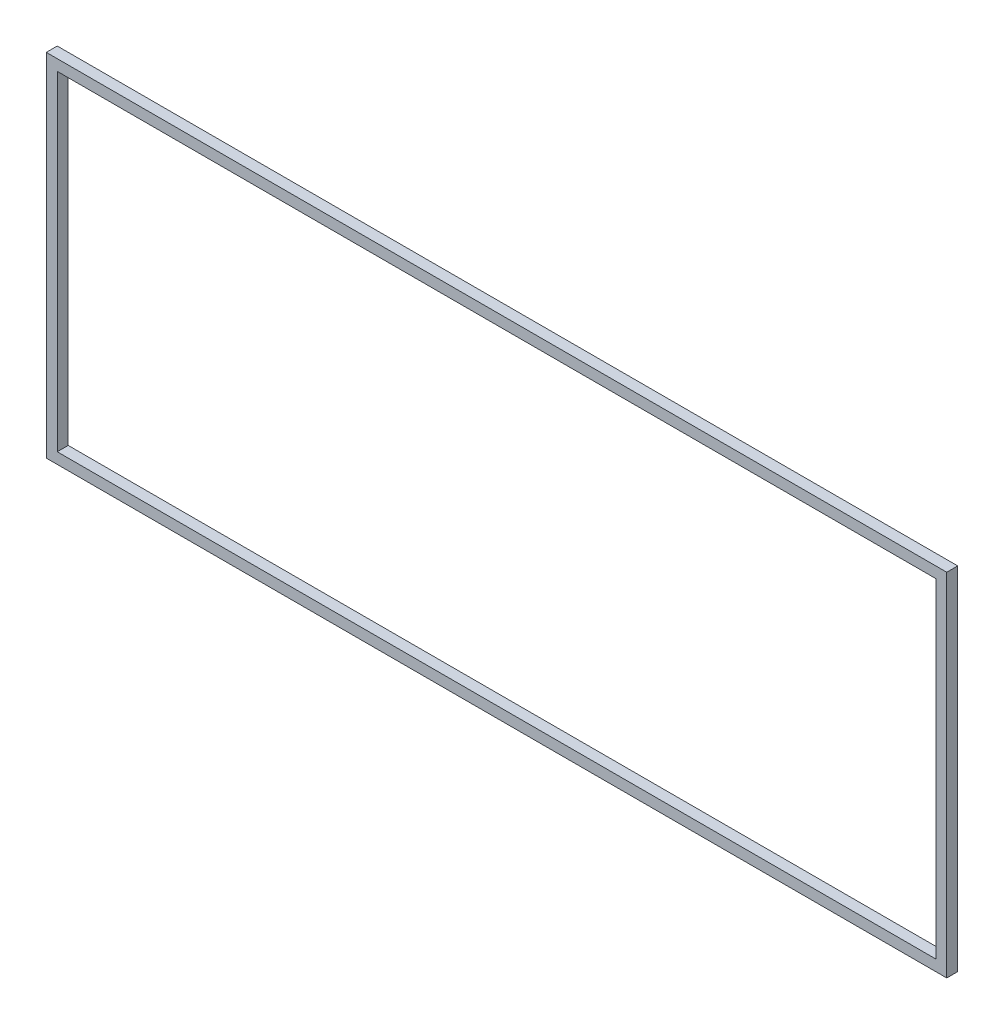
ISO-10303-21;
HEADER;
FILE_DESCRIPTION(('STEP AP214'),'2;1');
FILE_NAME('part.step','',(''),(''),'','','');
FILE_SCHEMA(('AUTOMOTIVE_DESIGN { 1 0 10303 214 1 1 1 1 }'));
ENDSEC;
DATA;
#1=APPLICATION_CONTEXT('core data for automotive mechanical design processes');
#2=APPLICATION_PROTOCOL_DEFINITION('international standard','automotive_design',2000,#1);
#3=PRODUCT_CONTEXT('',#1,'mechanical');
#4=PRODUCT('Part','Part','',(#3));
#5=PRODUCT_RELATED_PRODUCT_CATEGORY('part','',(#4));
#6=PRODUCT_DEFINITION_FORMATION('','',#4);
#7=PRODUCT_DEFINITION_CONTEXT('part definition',#1,'design');
#8=PRODUCT_DEFINITION('design','',#6,#7);
#9=PRODUCT_DEFINITION_SHAPE('','',#8);
#10=(LENGTH_UNIT() NAMED_UNIT(*) SI_UNIT(.MILLI.,.METRE.));
#11=(NAMED_UNIT(*) PLANE_ANGLE_UNIT() SI_UNIT($,.RADIAN.));
#12=(NAMED_UNIT(*) SI_UNIT($,.STERADIAN.) SOLID_ANGLE_UNIT());
#13=UNCERTAINTY_MEASURE_WITH_UNIT(LENGTH_MEASURE(1.E-05),#10,'distance_accuracy_value','');
#14=(GEOMETRIC_REPRESENTATION_CONTEXT(3) GLOBAL_UNCERTAINTY_ASSIGNED_CONTEXT((#13)) GLOBAL_UNIT_ASSIGNED_CONTEXT((#10,
#11,#12)) REPRESENTATION_CONTEXT('',''));
#15=CARTESIAN_POINT('',(0.,0.,0.));
#16=DIRECTION('',(0.,0.,1.));
#17=DIRECTION('',(1.,0.,0.));
#18=AXIS2_PLACEMENT_3D('',#15,#16,#17);
#19=CARTESIAN_POINT('',(87.357368028597,60.6995866341911,-39.));
#20=DIRECTION('',(0.,0.,-1.));
#21=DIRECTION('',(-1.,0.,0.));
#22=AXIS2_PLACEMENT_3D('',#19,#20,#21);
#23=PLANE('',#22);
#24=DIRECTION('',(1.,0.,0.));
#25=VECTOR('',#24,1.);
#26=CARTESIAN_POINT('',(95.457368028597,60.5995866341911,-39.));
#27=LINE('',#26,#25);
#28=CARTESIAN_POINT('',(87.457368028597,60.5995866341911,-39.));
#29=VERTEX_POINT('',#28);
#30=CARTESIAN_POINT('',(95.457368028597,60.5995866341911,-39.));
#31=VERTEX_POINT('',#30);
#32=EDGE_CURVE('E124',#29,#31,#27,.T.);
#33=ORIENTED_EDGE('',*,*,#32,.T.);
#34=DIRECTION('',(0.,1.,0.));
#35=VECTOR('',#34,1.);
#36=CARTESIAN_POINT('',(95.457368028597,57.5995866341911,-39.));
#37=LINE('',#36,#35);
#38=CARTESIAN_POINT('',(95.457368028597,57.5995866341911,-39.));
#39=VERTEX_POINT('',#38);
#40=EDGE_CURVE('E117',#31,#39,#37,.F.);
#41=ORIENTED_EDGE('',*,*,#40,.T.);
#42=DIRECTION('',(1.,0.,0.));
#43=VECTOR('',#42,1.);
#44=CARTESIAN_POINT('',(87.457368028597,57.5995866341911,-39.));
#45=LINE('',#44,#43);
#46=CARTESIAN_POINT('',(87.457368028597,57.5995866341911,-39.));
#47=VERTEX_POINT('',#46);
#48=EDGE_CURVE('E112',#39,#47,#45,.F.);
#49=ORIENTED_EDGE('',*,*,#48,.T.);
#50=DIRECTION('',(0.,1.,0.));
#51=VECTOR('',#50,1.);
#52=CARTESIAN_POINT('',(87.457368028597,60.5995866341911,-39.));
#53=LINE('',#52,#51);
#54=EDGE_CURVE('E108',#47,#29,#53,.T.);
#55=ORIENTED_EDGE('',*,*,#54,.T.);
#56=EDGE_LOOP('',(#33,#41,#49,#55));
#57=FACE_BOUND('',#56,.T.);
#58=DIRECTION('',(1.,0.,0.));
#59=VECTOR('',#58,1.);
#60=CARTESIAN_POINT('',(95.557368028597,57.4995866341911,-39.));
#61=LINE('',#60,#59);
#62=CARTESIAN_POINT('',(87.357368028597,57.4995866341911,-39.));
#63=VERTEX_POINT('',#62);
#64=CARTESIAN_POINT('',(95.557368028597,57.4995866341911,-39.));
#65=VERTEX_POINT('',#64);
#66=EDGE_CURVE('E106',#63,#65,#61,.T.);
#67=ORIENTED_EDGE('',*,*,#66,.T.);
#68=DIRECTION('',(0.,1.,0.));
#69=VECTOR('',#68,1.);
#70=CARTESIAN_POINT('',(95.557368028597,60.6995866341911,-39.));
#71=LINE('',#70,#69);
#72=CARTESIAN_POINT('',(95.557368028597,60.6995866341911,-39.));
#73=VERTEX_POINT('',#72);
#74=EDGE_CURVE('E92',#65,#73,#71,.T.);
#75=ORIENTED_EDGE('',*,*,#74,.T.);
#76=DIRECTION('',(1.,0.,0.));
#77=VECTOR('',#76,1.);
#78=CARTESIAN_POINT('',(87.357368028597,60.6995866341911,-39.));
#79=LINE('',#78,#77);
#80=CARTESIAN_POINT('',(87.357368028597,60.6995866341911,-39.));
#81=VERTEX_POINT('',#80);
#82=EDGE_CURVE('E79',#73,#81,#79,.F.);
#83=ORIENTED_EDGE('',*,*,#82,.T.);
#84=DIRECTION('',(0.,1.,0.));
#85=VECTOR('',#84,1.);
#86=CARTESIAN_POINT('',(87.357368028597,57.4995866341911,-39.));
#87=LINE('',#86,#85);
#88=EDGE_CURVE('E20',#81,#63,#87,.F.);
#89=ORIENTED_EDGE('',*,*,#88,.T.);
#90=EDGE_LOOP('',(#67,#75,#83,#89));
#91=FACE_BOUND('',#90,.T.);
#92=ADVANCED_FACE('F17',(#57,#91),#23,.F.);
#93=CARTESIAN_POINT('',(87.357368028597,57.4995866341911,-39.1));
#94=DIRECTION('',(1.,0.,0.));
#95=DIRECTION('',(0.,0.,-1.));
#96=AXIS2_PLACEMENT_3D('',#93,#94,#95);
#97=PLANE('',#96);
#98=DIRECTION('',(0.,0.,-1.));
#99=VECTOR('',#98,1.);
#100=CARTESIAN_POINT('',(87.357368028597,60.6995866341911,-39.1));
#101=LINE('',#100,#99);
#102=CARTESIAN_POINT('',(87.357368028597,60.6995866341911,-39.1));
#103=VERTEX_POINT('',#102);
#104=EDGE_CURVE('E85',#81,#103,#101,.T.);
#105=ORIENTED_EDGE('',*,*,#104,.T.);
#106=DIRECTION('',(0.,1.,0.));
#107=VECTOR('',#106,1.);
#108=CARTESIAN_POINT('',(87.357368028597,60.6995866341911,-39.1));
#109=LINE('',#108,#107);
#110=CARTESIAN_POINT('',(87.357368028597,57.4995866341911,-39.1));
#111=VERTEX_POINT('',#110);
#112=EDGE_CURVE('E127',#111,#103,#109,.T.);
#113=ORIENTED_EDGE('',*,*,#112,.F.);
#114=DIRECTION('',(0.,0.,1.));
#115=VECTOR('',#114,1.);
#116=CARTESIAN_POINT('',(87.357368028597,57.4995866341911,-39.1));
#117=LINE('',#116,#115);
#118=EDGE_CURVE('E88',#111,#63,#117,.T.);
#119=ORIENTED_EDGE('',*,*,#118,.T.);
#120=ORIENTED_EDGE('',*,*,#88,.F.);
#121=EDGE_LOOP('',(#105,#113,#119,#120));
#122=FACE_BOUND('',#121,.T.);
#123=ADVANCED_FACE('F84',(#122),#97,.F.);
#124=CARTESIAN_POINT('',(87.357368028597,60.6995866341911,-39.1));
#125=DIRECTION('',(0.,-1.,0.));
#126=DIRECTION('',(0.,0.,-1.));
#127=AXIS2_PLACEMENT_3D('',#124,#125,#126);
#128=PLANE('',#127);
#129=DIRECTION('',(0.,0.,1.));
#130=VECTOR('',#129,1.);
#131=CARTESIAN_POINT('',(95.557368028597,60.6995866341911,-39.1));
#132=LINE('',#131,#130);
#133=CARTESIAN_POINT('',(95.557368028597,60.6995866341911,-39.1));
#134=VERTEX_POINT('',#133);
#135=EDGE_CURVE('E94',#73,#134,#132,.F.);
#136=ORIENTED_EDGE('',*,*,#135,.T.);
#137=DIRECTION('',(-1.,0.,0.));
#138=VECTOR('',#137,1.);
#139=CARTESIAN_POINT('',(87.357368028597,60.6995866341911,-39.1));
#140=LINE('',#139,#138);
#141=EDGE_CURVE('E98',#103,#134,#140,.F.);
#142=ORIENTED_EDGE('',*,*,#141,.F.);
#143=ORIENTED_EDGE('',*,*,#104,.F.);
#144=ORIENTED_EDGE('',*,*,#82,.F.);
#145=EDGE_LOOP('',(#136,#142,#143,#144));
#146=FACE_BOUND('',#145,.T.);
#147=ADVANCED_FACE('F96',(#146),#128,.F.);
#148=CARTESIAN_POINT('',(95.557368028597,60.6995866341911,-39.1));
#149=DIRECTION('',(-1.,0.,0.));
#150=DIRECTION('',(0.,0.,1.));
#151=AXIS2_PLACEMENT_3D('',#148,#149,#150);
#152=PLANE('',#151);
#153=DIRECTION('',(0.,0.,1.));
#154=VECTOR('',#153,1.);
#155=CARTESIAN_POINT('',(95.557368028597,57.4995866341911,-39.1));
#156=LINE('',#155,#154);
#157=CARTESIAN_POINT('',(95.557368028597,57.4995866341911,-39.1));
#158=VERTEX_POINT('',#157);
#159=EDGE_CURVE('E103',#65,#158,#156,.F.);
#160=ORIENTED_EDGE('',*,*,#159,.T.);
#161=DIRECTION('',(0.,1.,0.));
#162=VECTOR('',#161,1.);
#163=CARTESIAN_POINT('',(95.557368028597,60.6995866341911,-39.1));
#164=LINE('',#163,#162);
#165=EDGE_CURVE('E130',#134,#158,#164,.F.);
#166=ORIENTED_EDGE('',*,*,#165,.F.);
#167=ORIENTED_EDGE('',*,*,#135,.F.);
#168=ORIENTED_EDGE('',*,*,#74,.F.);
#169=EDGE_LOOP('',(#160,#166,#167,#168));
#170=FACE_BOUND('',#169,.T.);
#171=ADVANCED_FACE('F168',(#170),#152,.F.);
#172=CARTESIAN_POINT('',(95.557368028597,57.4995866341911,-39.1));
#173=DIRECTION('',(0.,1.,0.));
#174=DIRECTION('',(0.,0.,1.));
#175=AXIS2_PLACEMENT_3D('',#172,#173,#174);
#176=PLANE('',#175);
#177=ORIENTED_EDGE('',*,*,#118,.F.);
#178=DIRECTION('',(-1.,0.,0.));
#179=VECTOR('',#178,1.);
#180=CARTESIAN_POINT('',(87.357368028597,57.4995866341911,-39.1));
#181=LINE('',#180,#179);
#182=EDGE_CURVE('E133',#158,#111,#181,.T.);
#183=ORIENTED_EDGE('',*,*,#182,.F.);
#184=ORIENTED_EDGE('',*,*,#159,.F.);
#185=ORIENTED_EDGE('',*,*,#66,.F.);
#186=EDGE_LOOP('',(#177,#183,#184,#185));
#187=FACE_BOUND('',#186,.T.);
#188=ADVANCED_FACE('F160',(#187),#176,.F.);
#189=CARTESIAN_POINT('',(87.457368028597,60.5995866341911,-39.1));
#190=DIRECTION('',(-1.,0.,0.));
#191=DIRECTION('',(0.,0.,1.));
#192=AXIS2_PLACEMENT_3D('',#189,#190,#191);
#193=PLANE('',#192);
#194=DIRECTION('',(0.,0.,-1.));
#195=VECTOR('',#194,1.);
#196=CARTESIAN_POINT('',(87.457368028597,57.5995866341911,-39.1));
#197=LINE('',#196,#195);
#198=CARTESIAN_POINT('',(87.457368028597,57.5995866341911,-39.1));
#199=VERTEX_POINT('',#198);
#200=EDGE_CURVE('E110',#47,#199,#197,.T.);
#201=ORIENTED_EDGE('',*,*,#200,.T.);
#202=DIRECTION('',(0.,1.,0.));
#203=VECTOR('',#202,1.);
#204=CARTESIAN_POINT('',(87.457368028597,60.6995866341911,-39.1));
#205=LINE('',#204,#203);
#206=CARTESIAN_POINT('',(87.457368028597,60.5995866341911,-39.1));
#207=VERTEX_POINT('',#206);
#208=EDGE_CURVE('E136',#207,#199,#205,.F.);
#209=ORIENTED_EDGE('',*,*,#208,.F.);
#210=DIRECTION('',(0.,0.,1.));
#211=VECTOR('',#210,1.);
#212=CARTESIAN_POINT('',(87.457368028597,60.5995866341911,-39.1));
#213=LINE('',#212,#211);
#214=EDGE_CURVE('E121',#207,#29,#213,.T.);
#215=ORIENTED_EDGE('',*,*,#214,.T.);
#216=ORIENTED_EDGE('',*,*,#54,.F.);
#217=EDGE_LOOP('',(#201,#209,#215,#216));
#218=FACE_BOUND('',#217,.T.);
#219=ADVANCED_FACE('F158',(#218),#193,.F.);
#220=CARTESIAN_POINT('',(87.457368028597,57.5995866341911,-39.1));
#221=DIRECTION('',(0.,-1.,0.));
#222=DIRECTION('',(0.,0.,-1.));
#223=AXIS2_PLACEMENT_3D('',#220,#221,#222);
#224=PLANE('',#223);
#225=DIRECTION('',(0.,0.,-1.));
#226=VECTOR('',#225,1.);
#227=CARTESIAN_POINT('',(95.457368028597,57.5995866341911,-39.1));
#228=LINE('',#227,#226);
#229=CARTESIAN_POINT('',(95.457368028597,57.5995866341911,-39.1));
#230=VERTEX_POINT('',#229);
#231=EDGE_CURVE('E115',#39,#230,#228,.T.);
#232=ORIENTED_EDGE('',*,*,#231,.T.);
#233=DIRECTION('',(-1.,0.,0.));
#234=VECTOR('',#233,1.);
#235=CARTESIAN_POINT('',(87.357368028597,57.5995866341911,-39.1));
#236=LINE('',#235,#234);
#237=EDGE_CURVE('E139',#199,#230,#236,.F.);
#238=ORIENTED_EDGE('',*,*,#237,.F.);
#239=ORIENTED_EDGE('',*,*,#200,.F.);
#240=ORIENTED_EDGE('',*,*,#48,.F.);
#241=EDGE_LOOP('',(#232,#238,#239,#240));
#242=FACE_BOUND('',#241,.T.);
#243=ADVANCED_FACE('F150',(#242),#224,.F.);
#244=CARTESIAN_POINT('',(95.457368028597,57.5995866341911,-39.1));
#245=DIRECTION('',(1.,0.,0.));
#246=DIRECTION('',(0.,0.,-1.));
#247=AXIS2_PLACEMENT_3D('',#244,#245,#246);
#248=PLANE('',#247);
#249=DIRECTION('',(0.,0.,1.));
#250=VECTOR('',#249,1.);
#251=CARTESIAN_POINT('',(95.457368028597,60.5995866341911,-39.1));
#252=LINE('',#251,#250);
#253=CARTESIAN_POINT('',(95.457368028597,60.5995866341911,-39.1));
#254=VERTEX_POINT('',#253);
#255=EDGE_CURVE('E35',#31,#254,#252,.F.);
#256=ORIENTED_EDGE('',*,*,#255,.T.);
#257=DIRECTION('',(0.,1.,0.));
#258=VECTOR('',#257,1.);
#259=CARTESIAN_POINT('',(95.457368028597,60.6995866341911,-39.1));
#260=LINE('',#259,#258);
#261=EDGE_CURVE('E26',#230,#254,#260,.T.);
#262=ORIENTED_EDGE('',*,*,#261,.F.);
#263=ORIENTED_EDGE('',*,*,#231,.F.);
#264=ORIENTED_EDGE('',*,*,#40,.F.);
#265=EDGE_LOOP('',(#256,#262,#263,#264));
#266=FACE_BOUND('',#265,.T.);
#267=ADVANCED_FACE('F148',(#266),#248,.F.);
#268=CARTESIAN_POINT('',(95.457368028597,60.5995866341911,-39.1));
#269=DIRECTION('',(0.,1.,0.));
#270=DIRECTION('',(0.,0.,1.));
#271=AXIS2_PLACEMENT_3D('',#268,#269,#270);
#272=PLANE('',#271);
#273=ORIENTED_EDGE('',*,*,#214,.F.);
#274=DIRECTION('',(-1.,0.,0.));
#275=VECTOR('',#274,1.);
#276=CARTESIAN_POINT('',(87.357368028597,60.5995866341911,-39.1));
#277=LINE('',#276,#275);
#278=EDGE_CURVE('E11',#254,#207,#277,.T.);
#279=ORIENTED_EDGE('',*,*,#278,.F.);
#280=ORIENTED_EDGE('',*,*,#255,.F.);
#281=ORIENTED_EDGE('',*,*,#32,.F.);
#282=EDGE_LOOP('',(#273,#279,#280,#281));
#283=FACE_BOUND('',#282,.T.);
#284=ADVANCED_FACE('F156',(#283),#272,.F.);
#285=CARTESIAN_POINT('',(87.357368028597,60.6995866341911,-39.1));
#286=DIRECTION('',(0.,0.,-1.));
#287=DIRECTION('',(-1.,0.,0.));
#288=AXIS2_PLACEMENT_3D('',#285,#286,#287);
#289=PLANE('',#288);
#290=ORIENTED_EDGE('',*,*,#261,.T.);
#291=ORIENTED_EDGE('',*,*,#278,.T.);
#292=ORIENTED_EDGE('',*,*,#208,.T.);
#293=ORIENTED_EDGE('',*,*,#237,.T.);
#294=EDGE_LOOP('',(#290,#291,#292,#293));
#295=FACE_BOUND('',#294,.T.);
#296=ORIENTED_EDGE('',*,*,#165,.T.);
#297=ORIENTED_EDGE('',*,*,#182,.T.);
#298=ORIENTED_EDGE('',*,*,#112,.T.);
#299=ORIENTED_EDGE('',*,*,#141,.T.);
#300=EDGE_LOOP('',(#296,#297,#298,#299));
#301=FACE_BOUND('',#300,.T.);
#302=ADVANCED_FACE('F144',(#295,#301),#289,.T.);
#303=CLOSED_SHELL('',(#92,#123,#147,#171,#188,#219,#243,#267,#284,#302));
#304=MANIFOLD_SOLID_BREP('B1',#303);
#305=ADVANCED_BREP_SHAPE_REPRESENTATION('',(#18,#304),#14);
#306=SHAPE_DEFINITION_REPRESENTATION(#9,#305);
ENDSEC;
END-ISO-10303-21;
